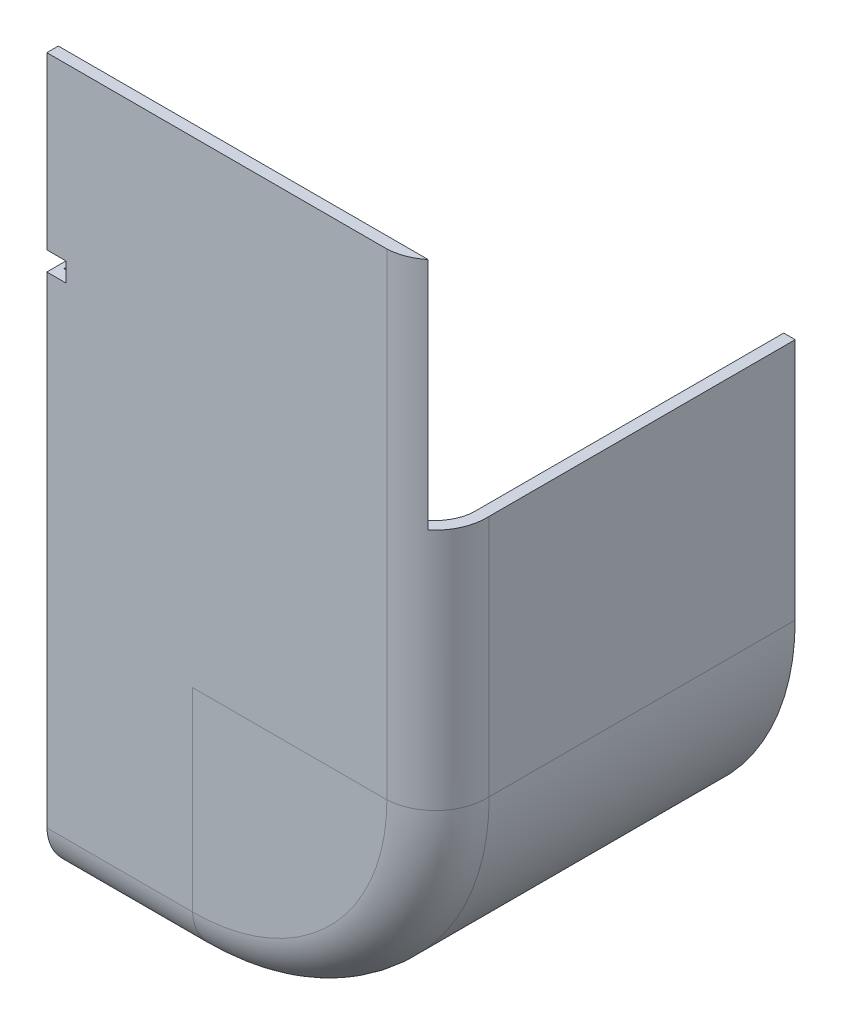
ISO-10303-21;
HEADER;
FILE_DESCRIPTION(('STEP AP214'),'2;1');
FILE_NAME('part.step','',(''),(''),'','','');
FILE_SCHEMA(('AUTOMOTIVE_DESIGN { 1 0 10303 214 1 1 1 1 }'));
ENDSEC;
DATA;
#1=APPLICATION_CONTEXT('core data for automotive mechanical design processes');
#2=APPLICATION_PROTOCOL_DEFINITION('international standard','automotive_design',2000,#1);
#3=PRODUCT_CONTEXT('',#1,'mechanical');
#4=PRODUCT('Part','Part','',(#3));
#5=PRODUCT_RELATED_PRODUCT_CATEGORY('part','',(#4));
#6=PRODUCT_DEFINITION_FORMATION('','',#4);
#7=PRODUCT_DEFINITION_CONTEXT('part definition',#1,'design');
#8=PRODUCT_DEFINITION('design','',#6,#7);
#9=PRODUCT_DEFINITION_SHAPE('','',#8);
#10=(LENGTH_UNIT() NAMED_UNIT(*) SI_UNIT(.MILLI.,.METRE.));
#11=(NAMED_UNIT(*) PLANE_ANGLE_UNIT() SI_UNIT($,.RADIAN.));
#12=(NAMED_UNIT(*) SI_UNIT($,.STERADIAN.) SOLID_ANGLE_UNIT());
#13=UNCERTAINTY_MEASURE_WITH_UNIT(LENGTH_MEASURE(1.E-05),#10,'distance_accuracy_value','');
#14=(GEOMETRIC_REPRESENTATION_CONTEXT(3) GLOBAL_UNCERTAINTY_ASSIGNED_CONTEXT((#13)) GLOBAL_UNIT_ASSIGNED_CONTEXT((#10,
#11,#12)) REPRESENTATION_CONTEXT('',''));
#15=CARTESIAN_POINT('',(0.,0.,0.));
#16=DIRECTION('',(0.,0.,1.));
#17=DIRECTION('',(1.,0.,0.));
#18=AXIS2_PLACEMENT_3D('',#15,#16,#17);
#19=CARTESIAN_POINT('',(-38.1,101.6,91.0390992622291));
#20=DIRECTION('',(0.,0.,1.));
#21=DIRECTION('',(1.,0.,0.));
#22=AXIS2_PLACEMENT_3D('',#19,#20,#21);
#23=PLANE('',#22);
#24=DIRECTION('',(-1.,0.,0.));
#25=VECTOR('',#24,1.);
#26=CARTESIAN_POINT('',(-38.1,41.9405176116687,91.0390992622291));
#27=LINE('',#26,#25);
#28=CARTESIAN_POINT('',(5.,41.9405176116687,91.0390992622291));
#29=VERTEX_POINT('',#28);
#30=CARTESIAN_POINT('',(0.,41.9405176116687,91.0390992622291));
#31=VERTEX_POINT('',#30);
#32=EDGE_CURVE('E285',#29,#31,#27,.T.);
#33=ORIENTED_EDGE('',*,*,#32,.T.);
#34=DIRECTION('',(0.,1.,0.));
#35=VECTOR('',#34,1.);
#36=CARTESIAN_POINT('',(0.,101.6,91.0390992622291));
#37=LINE('',#36,#35);
#38=CARTESIAN_POINT('',(0.,86.6,91.0390992622291));
#39=VERTEX_POINT('',#38);
#40=EDGE_CURVE('E282',#31,#39,#37,.T.);
#41=ORIENTED_EDGE('',*,*,#40,.T.);
#42=DIRECTION('',(-1.,0.,0.));
#43=VECTOR('',#42,1.);
#44=CARTESIAN_POINT('',(-38.1,86.6,91.0390992622291));
#45=LINE('',#44,#43);
#46=CARTESIAN_POINT('',(96.6960037763841,86.6,91.0390992622291));
#47=VERTEX_POINT('',#46);
#48=EDGE_CURVE('E307',#47,#39,#45,.T.);
#49=ORIENTED_EDGE('',*,*,#48,.F.);
#50=DIRECTION('',(0.,1.,0.));
#51=VECTOR('',#50,1.);
#52=CARTESIAN_POINT('',(96.6960037763841,-38.0999999999997,91.0390992622291));
#53=LINE('',#52,#51);
#54=CARTESIAN_POINT('',(96.6960037763841,25.4,91.0390992622291));
#55=VERTEX_POINT('',#54);
#56=EDGE_CURVE('E340',#55,#47,#53,.T.);
#57=ORIENTED_EDGE('',*,*,#56,.F.);
#58=DIRECTION('',(1.,0.,0.));
#59=VECTOR('',#58,1.);
#60=CARTESIAN_POINT('',(122.458490874742,25.4,91.0390992622291));
#61=LINE('',#60,#59);
#62=CARTESIAN_POINT('',(88.8999999999999,25.4,91.0390992622291));
#63=VERTEX_POINT('',#62);
#64=EDGE_CURVE('E348',#63,#55,#61,.T.);
#65=ORIENTED_EDGE('',*,*,#64,.F.);
#66=DIRECTION('',(0.,1.,0.));
#67=VECTOR('',#66,1.);
#68=CARTESIAN_POINT('',(88.9,-38.0999999999997,91.0390992622291));
#69=LINE('',#68,#67);
#70=CARTESIAN_POINT('',(88.9,-38.0999999999997,91.0390992622291));
#71=VERTEX_POINT('',#70);
#72=EDGE_CURVE('E528',#71,#63,#69,.T.);
#73=ORIENTED_EDGE('',*,*,#72,.F.);
#74=DIRECTION('',(1.,0.,0.));
#75=VECTOR('',#74,1.);
#76=CARTESIAN_POINT('',(38.1,-38.0999999999996,91.0390992622291));
#77=LINE('',#76,#75);
#78=CARTESIAN_POINT('',(38.0999999999997,-38.1000000000001,91.0390992622291));
#79=VERTEX_POINT('',#78);
#80=EDGE_CURVE('E414',#79,#71,#77,.T.);
#81=ORIENTED_EDGE('',*,*,#80,.F.);
#82=DIRECTION('',(0.,-1.,0.));
#83=VECTOR('',#82,1.);
#84=CARTESIAN_POINT('',(38.0999999999997,-38.1000000000001,91.0390992622291));
#85=LINE('',#84,#83);
#86=CARTESIAN_POINT('',(38.0999999999996,-88.9000000000001,91.0390992622291));
#87=VERTEX_POINT('',#86);
#88=EDGE_CURVE('E284',#79,#87,#85,.T.);
#89=ORIENTED_EDGE('',*,*,#88,.T.);
#90=DIRECTION('',(1.,0.,0.));
#91=VECTOR('',#90,1.);
#92=CARTESIAN_POINT('',(-38.0999999999999,-88.9,91.0390992622291));
#93=LINE('',#92,#91);
#94=CARTESIAN_POINT('',(1.50000000000002,-88.9000000000001,91.0390992622291));
#95=VERTEX_POINT('',#94);
#96=EDGE_CURVE('E314',#95,#87,#93,.T.);
#97=ORIENTED_EDGE('',*,*,#96,.F.);
#98=DIRECTION('',(0.,-1.,0.));
#99=VECTOR('',#98,1.);
#100=CARTESIAN_POINT('',(1.50000000000002,36.9405176116687,91.0390992622291));
#101=LINE('',#100,#99);
#102=CARTESIAN_POINT('',(1.50000000000002,36.9405176116687,91.0390992622291));
#103=VERTEX_POINT('',#102);
#104=EDGE_CURVE('E258',#103,#95,#101,.T.);
#105=ORIENTED_EDGE('',*,*,#104,.F.);
#106=DIRECTION('',(1.,0.,0.));
#107=VECTOR('',#106,1.);
#108=CARTESIAN_POINT('',(-38.1,36.9405176116687,91.0390992622291));
#109=LINE('',#108,#107);
#110=CARTESIAN_POINT('',(5.,36.9405176116687,91.0390992622291));
#111=VERTEX_POINT('',#110);
#112=EDGE_CURVE('E253',#103,#111,#109,.T.);
#113=ORIENTED_EDGE('',*,*,#112,.T.);
#114=DIRECTION('',(0.,1.,0.));
#115=VECTOR('',#114,1.);
#116=CARTESIAN_POINT('',(4.99999999999998,101.6,91.0390992622291));
#117=LINE('',#116,#115);
#118=EDGE_CURVE('E426',#111,#29,#117,.T.);
#119=ORIENTED_EDGE('',*,*,#118,.T.);
#120=EDGE_LOOP('',(#33,#41,#49,#57,#65,#73,#81,#89,#97,#105,#113,#119));
#121=FACE_BOUND('',#120,.T.);
#122=ADVANCED_FACE('F70',(#121),#23,.F.);
#123=CARTESIAN_POINT('',(-38.0999999999999,-98.6,60.));
#124=DIRECTION('',(0.,1.,0.));
#125=DIRECTION('',(0.,0.,1.));
#126=AXIS2_PLACEMENT_3D('',#123,#124,#125);
#127=PLANE('',#126);
#128=DIRECTION('',(1.,0.,0.));
#129=VECTOR('',#128,1.);
#130=CARTESIAN_POINT('',(-38.0999999999999,-98.6,40.));
#131=LINE('',#130,#129);
#132=CARTESIAN_POINT('',(1.49999999999999,-98.6,40.));
#133=VERTEX_POINT('',#132);
#134=CARTESIAN_POINT('',(27.4999999999999,-98.6,40.));
#135=VERTEX_POINT('',#134);
#136=EDGE_CURVE('E370',#133,#135,#131,.T.);
#137=ORIENTED_EDGE('',*,*,#136,.F.);
#138=DIRECTION('',(0.,0.,-1.));
#139=VECTOR('',#138,1.);
#140=CARTESIAN_POINT('',(1.5,-98.6,80.));
#141=LINE('',#140,#139);
#142=CARTESIAN_POINT('',(1.5,-98.6,80.));
#143=VERTEX_POINT('',#142);
#144=EDGE_CURVE('E386',#143,#133,#141,.T.);
#145=ORIENTED_EDGE('',*,*,#144,.F.);
#146=DIRECTION('',(1.,0.,0.));
#147=VECTOR('',#146,1.);
#148=CARTESIAN_POINT('',(-38.0999999999999,-98.6,80.));
#149=LINE('',#148,#147);
#150=CARTESIAN_POINT('',(38.0999999999996,-98.6000000000001,80.));
#151=VERTEX_POINT('',#150);
#152=EDGE_CURVE('E529',#143,#151,#149,.T.);
#153=ORIENTED_EDGE('',*,*,#152,.T.);
#154=DIRECTION('',(0.,0.,-1.));
#155=VECTOR('',#154,1.);
#156=CARTESIAN_POINT('',(38.0999999999995,-98.6,60.));
#157=LINE('',#156,#155);
#158=CARTESIAN_POINT('',(38.0999999999995,-98.6,0.));
#159=VERTEX_POINT('',#158);
#160=EDGE_CURVE('E530',#151,#159,#157,.T.);
#161=ORIENTED_EDGE('',*,*,#160,.T.);
#162=DIRECTION('',(1.,0.,0.));
#163=VECTOR('',#162,1.);
#164=CARTESIAN_POINT('',(-38.0999999999999,-98.6,0.));
#165=LINE('',#164,#163);
#166=CARTESIAN_POINT('',(27.4999999999999,-98.6,0.));
#167=VERTEX_POINT('',#166);
#168=EDGE_CURVE('E343',#167,#159,#165,.T.);
#169=ORIENTED_EDGE('',*,*,#168,.F.);
#170=DIRECTION('',(0.,0.,-1.));
#171=VECTOR('',#170,1.);
#172=CARTESIAN_POINT('',(27.4999999999999,-98.6,60.));
#173=LINE('',#172,#171);
#174=EDGE_CURVE('E361',#135,#167,#173,.T.);
#175=ORIENTED_EDGE('',*,*,#174,.F.);
#176=EDGE_LOOP('',(#137,#145,#153,#161,#169,#175));
#177=FACE_BOUND('',#176,.T.);
#178=ADVANCED_FACE('F467',(#177),#127,.T.);
#179=CARTESIAN_POINT('',(-38.1,101.6,94.0390992622291));
#180=DIRECTION('',(0.,0.,-1.));
#181=DIRECTION('',(-1.,0.,0.));
#182=AXIS2_PLACEMENT_3D('',#179,#180,#181);
#183=PLANE('',#182);
#184=DIRECTION('',(1.,0.,0.));
#185=VECTOR('',#184,1.);
#186=CARTESIAN_POINT('',(-38.1,86.6,94.0390992622291));
#187=LINE('',#186,#185);
#188=CARTESIAN_POINT('',(0.,86.6,94.0390992622291));
#189=VERTEX_POINT('',#188);
#190=CARTESIAN_POINT('',(88.9,86.6,94.0390992622291));
#191=VERTEX_POINT('',#190);
#192=EDGE_CURVE('E369',#189,#191,#187,.T.);
#193=ORIENTED_EDGE('',*,*,#192,.F.);
#194=DIRECTION('',(0.,-1.,0.));
#195=VECTOR('',#194,1.);
#196=CARTESIAN_POINT('',(0.,101.6,94.0390992622291));
#197=LINE('',#196,#195);
#198=CARTESIAN_POINT('',(0.,41.9405176116687,94.0390992622291));
#199=VERTEX_POINT('',#198);
#200=EDGE_CURVE('E312',#189,#199,#197,.T.);
#201=ORIENTED_EDGE('',*,*,#200,.T.);
#202=DIRECTION('',(-1.,0.,0.));
#203=VECTOR('',#202,1.);
#204=CARTESIAN_POINT('',(-5.,41.9405176116687,94.0390992622291));
#205=LINE('',#204,#203);
#206=CARTESIAN_POINT('',(5.,41.9405176116687,94.0390992622291));
#207=VERTEX_POINT('',#206);
#208=EDGE_CURVE('E281',#207,#199,#205,.T.);
#209=ORIENTED_EDGE('',*,*,#208,.F.);
#210=DIRECTION('',(0.,1.,0.));
#211=VECTOR('',#210,1.);
#212=CARTESIAN_POINT('',(5.,41.9405176116687,94.0390992622291));
#213=LINE('',#212,#211);
#214=CARTESIAN_POINT('',(5.,36.9405176116687,94.0390992622291));
#215=VERTEX_POINT('',#214);
#216=EDGE_CURVE('E271',#215,#207,#213,.T.);
#217=ORIENTED_EDGE('',*,*,#216,.F.);
#218=DIRECTION('',(1.,0.,0.));
#219=VECTOR('',#218,1.);
#220=CARTESIAN_POINT('',(-5.,36.9405176116687,94.0390992622291));
#221=LINE('',#220,#219);
#222=CARTESIAN_POINT('',(0.,36.9405176116687,94.0390992622291));
#223=VERTEX_POINT('',#222);
#224=EDGE_CURVE('E273',#223,#215,#221,.T.);
#225=ORIENTED_EDGE('',*,*,#224,.F.);
#226=CARTESIAN_POINT('',(0.,-88.9000000000001,94.0390992622291));
#227=VERTEX_POINT('',#226);
#228=EDGE_CURVE('E308',#223,#227,#197,.T.);
#229=ORIENTED_EDGE('',*,*,#228,.T.);
#230=DIRECTION('',(1.,0.,0.));
#231=VECTOR('',#230,1.);
#232=CARTESIAN_POINT('',(-38.0999999999999,-88.9,94.0390992622291));
#233=LINE('',#232,#231);
#234=CARTESIAN_POINT('',(38.0999999999996,-88.9000000000001,94.0390992622291));
#235=VERTEX_POINT('',#234);
#236=EDGE_CURVE('E311',#227,#235,#233,.T.);
#237=ORIENTED_EDGE('',*,*,#236,.T.);
#238=DIRECTION('',(0.,1.,0.));
#239=VECTOR('',#238,1.);
#240=CARTESIAN_POINT('',(38.0999999999997,-38.1000000000001,94.0390992622291));
#241=LINE('',#240,#239);
#242=CARTESIAN_POINT('',(38.0999999999997,-38.1000000000001,94.0390992622291));
#243=VERTEX_POINT('',#242);
#244=EDGE_CURVE('E433',#235,#243,#241,.T.);
#245=ORIENTED_EDGE('',*,*,#244,.T.);
#246=DIRECTION('',(-1.,0.,0.));
#247=VECTOR('',#246,1.);
#248=CARTESIAN_POINT('',(38.1,-38.0999999999996,94.0390992622291));
#249=LINE('',#248,#247);
#250=CARTESIAN_POINT('',(88.9,-38.0999999999997,94.0390992622291));
#251=VERTEX_POINT('',#250);
#252=EDGE_CURVE('E430',#251,#243,#249,.T.);
#253=ORIENTED_EDGE('',*,*,#252,.F.);
#254=DIRECTION('',(0.,1.,0.));
#255=VECTOR('',#254,1.);
#256=CARTESIAN_POINT('',(88.9,-38.0999999999997,94.0390992622291));
#257=LINE('',#256,#255);
#258=EDGE_CURVE('E335',#251,#191,#257,.T.);
#259=ORIENTED_EDGE('',*,*,#258,.T.);
#260=EDGE_LOOP('',(#193,#201,#209,#217,#225,#229,#237,#245,#253,#259));
#261=FACE_BOUND('',#260,.T.);
#262=ADVANCED_FACE('F453',(#261),#183,.F.);
#263=CARTESIAN_POINT('',(88.2304503688854,-38.0999999999997,80.6695496311146));
#264=DIRECTION('',(0.,1.,0.));
#265=DIRECTION('',(0.,0.,1.));
#266=AXIS2_PLACEMENT_3D('',#263,#264,#265);
#267=CYLINDRICAL_SURFACE('',#266,13.3863047196514);
#268=CARTESIAN_POINT('',(88.2304503688854,86.6,80.6695496311146));
#269=DIRECTION('',(0.,1.,0.));
#270=DIRECTION('',(-1.,0.,0.));
#271=AXIS2_PLACEMENT_3D('',#268,#269,#270);
#272=CIRCLE('',#271,13.3863047196514);
#273=EDGE_CURVE('E379',#191,#47,#272,.T.);
#274=ORIENTED_EDGE('',*,*,#273,.F.);
#275=ORIENTED_EDGE('',*,*,#258,.F.);
#276=CARTESIAN_POINT('',(88.2304503688854,-38.0999999999997,80.6695496311146));
#277=DIRECTION('',(0.,-1.,0.));
#278=DIRECTION('',(1.,0.,0.));
#279=AXIS2_PLACEMENT_3D('',#276,#277,#278);
#280=CIRCLE('',#279,13.3863047196514);
#281=CARTESIAN_POINT('',(101.6,-38.0999999999997,80.));
#282=VERTEX_POINT('',#281);
#283=EDGE_CURVE('E338',#282,#251,#280,.T.);
#284=ORIENTED_EDGE('',*,*,#283,.F.);
#285=DIRECTION('',(0.,1.,0.));
#286=VECTOR('',#285,1.);
#287=CARTESIAN_POINT('',(101.6,-38.0999999999997,80.));
#288=LINE('',#287,#286);
#289=CARTESIAN_POINT('',(101.6,25.4,80.));
#290=VERTEX_POINT('',#289);
#291=EDGE_CURVE('E331',#282,#290,#288,.T.);
#292=ORIENTED_EDGE('',*,*,#291,.T.);
#293=CARTESIAN_POINT('',(88.2304503688854,25.4,80.6695496311146));
#294=DIRECTION('',(0.,-1.,0.));
#295=DIRECTION('',(1.,0.,0.));
#296=AXIS2_PLACEMENT_3D('',#293,#294,#295);
#297=CIRCLE('',#296,13.3863047196514);
#298=EDGE_CURVE('E334',#290,#55,#297,.T.);
#299=ORIENTED_EDGE('',*,*,#298,.T.);
#300=ORIENTED_EDGE('',*,*,#56,.T.);
#301=EDGE_LOOP('',(#274,#275,#284,#292,#299,#300));
#302=FACE_BOUND('',#301,.T.);
#303=ADVANCED_FACE('F448',(#302),#267,.T.);
#304=CARTESIAN_POINT('',(38.0999999999995,-38.0999999999996,0.));
#305=DIRECTION('',(0.,0.,1.));
#306=DIRECTION('',(1.,0.,0.));
#307=AXIS2_PLACEMENT_3D('',#304,#305,#306);
#308=PLANE('',#307);
#309=DIRECTION('',(1.,0.,0.));
#310=VECTOR('',#309,1.);
#311=CARTESIAN_POINT('',(-38.0999999999999,-101.6,0.));
#312=LINE('',#311,#310);
#313=CARTESIAN_POINT('',(27.4999999999999,-101.6,0.));
#314=VERTEX_POINT('',#313);
#315=CARTESIAN_POINT('',(38.0999999999998,-101.6,0.));
#316=VERTEX_POINT('',#315);
#317=EDGE_CURVE('E296',#314,#316,#312,.T.);
#318=ORIENTED_EDGE('',*,*,#317,.F.);
#319=DIRECTION('',(0.,-1.,0.));
#320=VECTOR('',#319,1.);
#321=CARTESIAN_POINT('',(27.5000000000001,101.6,0.));
#322=LINE('',#321,#320);
#323=EDGE_CURVE('E371',#167,#314,#322,.T.);
#324=ORIENTED_EDGE('',*,*,#323,.F.);
#325=ORIENTED_EDGE('',*,*,#168,.T.);
#326=CARTESIAN_POINT('',(38.0999999999993,-38.0999999999993,0.));
#327=DIRECTION('',(0.,0.,-1.));
#328=DIRECTION('',(-1.,0.,0.));
#329=AXIS2_PLACEMENT_3D('',#326,#327,#328);
#330=CIRCLE('',#329,60.5000000000007);
#331=CARTESIAN_POINT('',(98.6,-38.0999999999996,0.));
#332=VERTEX_POINT('',#331);
#333=EDGE_CURVE('E517',#332,#159,#330,.T.);
#334=ORIENTED_EDGE('',*,*,#333,.F.);
#335=DIRECTION('',(0.,-1.,0.));
#336=VECTOR('',#335,1.);
#337=CARTESIAN_POINT('',(98.6,98.6,0.));
#338=LINE('',#337,#336);
#339=CARTESIAN_POINT('',(98.6,25.4,0.));
#340=VERTEX_POINT('',#339);
#341=EDGE_CURVE('E302',#340,#332,#338,.T.);
#342=ORIENTED_EDGE('',*,*,#341,.F.);
#343=DIRECTION('',(1.,0.,0.));
#344=VECTOR('',#343,1.);
#345=CARTESIAN_POINT('',(38.0999999999995,25.4,0.));
#346=LINE('',#345,#344);
#347=CARTESIAN_POINT('',(101.6,25.4,0.));
#348=VERTEX_POINT('',#347);
#349=EDGE_CURVE('E350',#340,#348,#346,.T.);
#350=ORIENTED_EDGE('',*,*,#349,.T.);
#351=DIRECTION('',(0.,-1.,0.));
#352=VECTOR('',#351,1.);
#353=CARTESIAN_POINT('',(101.6,101.6,0.));
#354=LINE('',#353,#352);
#355=CARTESIAN_POINT('',(101.6,-38.0999999999996,0.));
#356=VERTEX_POINT('',#355);
#357=EDGE_CURVE('E297',#348,#356,#354,.T.);
#358=ORIENTED_EDGE('',*,*,#357,.T.);
#359=CARTESIAN_POINT('',(38.0999999999995,-38.0999999999996,0.));
#360=DIRECTION('',(0.,0.,1.));
#361=DIRECTION('',(1.,0.,0.));
#362=AXIS2_PLACEMENT_3D('',#359,#360,#361);
#363=CIRCLE('',#362,63.5000000000005);
#364=EDGE_CURVE('E544',#316,#356,#363,.T.);
#365=ORIENTED_EDGE('',*,*,#364,.F.);
#366=EDGE_LOOP('',(#318,#324,#325,#334,#342,#350,#358,#365));
#367=FACE_BOUND('',#366,.T.);
#368=ADVANCED_FACE('F492',(#367),#308,.F.);
#369=CARTESIAN_POINT('',(-38.0999999999999,-101.6,60.));
#370=DIRECTION('',(0.,1.,0.));
#371=DIRECTION('',(-1.,0.,0.));
#372=AXIS2_PLACEMENT_3D('',#369,#370,#371);
#373=PLANE('',#372);
#374=DIRECTION('',(1.,0.,0.));
#375=VECTOR('',#374,1.);
#376=CARTESIAN_POINT('',(-38.0999999999999,-101.6,80.));
#377=LINE('',#376,#375);
#378=CARTESIAN_POINT('',(0.,-101.6,80.));
#379=VERTEX_POINT('',#378);
#380=CARTESIAN_POINT('',(38.0999999999996,-101.6,80.));
#381=VERTEX_POINT('',#380);
#382=EDGE_CURVE('E301',#379,#381,#377,.T.);
#383=ORIENTED_EDGE('',*,*,#382,.F.);
#384=DIRECTION('',(0.,0.,-1.));
#385=VECTOR('',#384,1.);
#386=CARTESIAN_POINT('',(0.,-101.6,60.));
#387=LINE('',#386,#385);
#388=CARTESIAN_POINT('',(0.,-101.6,40.));
#389=VERTEX_POINT('',#388);
#390=EDGE_CURVE('E293',#379,#389,#387,.T.);
#391=ORIENTED_EDGE('',*,*,#390,.T.);
#392=DIRECTION('',(-1.,0.,0.));
#393=VECTOR('',#392,1.);
#394=CARTESIAN_POINT('',(-27.5000000000001,-101.6,40.));
#395=LINE('',#394,#393);
#396=CARTESIAN_POINT('',(27.4999999999999,-101.6,40.));
#397=VERTEX_POINT('',#396);
#398=EDGE_CURVE('E291',#397,#389,#395,.T.);
#399=ORIENTED_EDGE('',*,*,#398,.F.);
#400=DIRECTION('',(0.,0.,1.));
#401=VECTOR('',#400,1.);
#402=CARTESIAN_POINT('',(27.4999999999999,-101.6,0.));
#403=LINE('',#402,#401);
#404=EDGE_CURVE('E373',#314,#397,#403,.T.);
#405=ORIENTED_EDGE('',*,*,#404,.F.);
#406=ORIENTED_EDGE('',*,*,#317,.T.);
#407=DIRECTION('',(0.,0.,-1.));
#408=VECTOR('',#407,1.);
#409=CARTESIAN_POINT('',(38.0999999999998,-101.6,60.));
#410=LINE('',#409,#408);
#411=EDGE_CURVE('E541',#381,#316,#410,.T.);
#412=ORIENTED_EDGE('',*,*,#411,.F.);
#413=EDGE_LOOP('',(#383,#391,#399,#405,#406,#412));
#414=FACE_BOUND('',#413,.T.);
#415=ADVANCED_FACE('F495',(#414),#373,.F.);
#416=CARTESIAN_POINT('',(38.0999999999995,-38.0999999999996,60.));
#417=DIRECTION('',(0.,0.,-1.));
#418=DIRECTION('',(-1.,0.,0.));
#419=AXIS2_PLACEMENT_3D('',#416,#417,#418);
#420=CYLINDRICAL_SURFACE('',#419,63.5000000000005);
#421=ORIENTED_EDGE('',*,*,#364,.T.);
#422=DIRECTION('',(0.,0.,-1.));
#423=VECTOR('',#422,1.);
#424=CARTESIAN_POINT('',(101.6,-38.0999999999996,60.));
#425=LINE('',#424,#423);
#426=EDGE_CURVE('E539',#282,#356,#425,.T.);
#427=ORIENTED_EDGE('',*,*,#426,.F.);
#428=CARTESIAN_POINT('',(38.0999999999996,-38.0999999999997,80.));
#429=DIRECTION('',(0.,0.,1.));
#430=DIRECTION('',(0.,-1.,0.));
#431=AXIS2_PLACEMENT_3D('',#428,#429,#430);
#432=CIRCLE('',#431,63.5000000000004);
#433=EDGE_CURVE('E336',#381,#282,#432,.T.);
#434=ORIENTED_EDGE('',*,*,#433,.F.);
#435=ORIENTED_EDGE('',*,*,#411,.T.);
#436=EDGE_LOOP('',(#421,#427,#434,#435));
#437=FACE_BOUND('',#436,.T.);
#438=ADVANCED_FACE('F499',(#437),#420,.T.);
#439=CARTESIAN_POINT('',(101.6,101.6,60.));
#440=DIRECTION('',(1.,0.,0.));
#441=DIRECTION('',(0.,1.,0.));
#442=AXIS2_PLACEMENT_3D('',#439,#440,#441);
#443=PLANE('',#442);
#444=DIRECTION('',(0.,0.,-1.));
#445=VECTOR('',#444,1.);
#446=CARTESIAN_POINT('',(101.6,25.4,60.));
#447=LINE('',#446,#445);
#448=EDGE_CURVE('E346',#290,#348,#447,.T.);
#449=ORIENTED_EDGE('',*,*,#448,.F.);
#450=ORIENTED_EDGE('',*,*,#291,.F.);
#451=ORIENTED_EDGE('',*,*,#426,.T.);
#452=ORIENTED_EDGE('',*,*,#357,.F.);
#453=EDGE_LOOP('',(#449,#450,#451,#452));
#454=FACE_BOUND('',#453,.T.);
#455=ADVANCED_FACE('F487',(#454),#443,.T.);
#456=CARTESIAN_POINT('',(38.0999999999993,-38.0999999999993,60.));
#457=DIRECTION('',(0.,0.,-1.));
#458=DIRECTION('',(-1.,0.,0.));
#459=AXIS2_PLACEMENT_3D('',#456,#457,#458);
#460=CYLINDRICAL_SURFACE('',#459,60.5000000000007);
#461=ORIENTED_EDGE('',*,*,#333,.T.);
#462=ORIENTED_EDGE('',*,*,#160,.F.);
#463=CARTESIAN_POINT('',(38.0999999999996,-38.0999999999997,80.));
#464=DIRECTION('',(0.,0.,1.));
#465=DIRECTION('',(0.,-1.,0.));
#466=AXIS2_PLACEMENT_3D('',#463,#464,#465);
#467=CIRCLE('',#466,60.5000000000004);
#468=CARTESIAN_POINT('',(98.6,-38.0999999999997,80.));
#469=VERTEX_POINT('',#468);
#470=EDGE_CURVE('E422',#151,#469,#467,.T.);
#471=ORIENTED_EDGE('',*,*,#470,.T.);
#472=DIRECTION('',(0.,0.,-1.));
#473=VECTOR('',#472,1.);
#474=CARTESIAN_POINT('',(98.6,-38.0999999999996,60.));
#475=LINE('',#474,#473);
#476=EDGE_CURVE('E525',#469,#332,#475,.T.);
#477=ORIENTED_EDGE('',*,*,#476,.T.);
#478=EDGE_LOOP('',(#461,#462,#471,#477));
#479=FACE_BOUND('',#478,.T.);
#480=ADVANCED_FACE('F484',(#479),#460,.F.);
#481=CARTESIAN_POINT('',(98.6,98.6,60.));
#482=DIRECTION('',(1.,0.,0.));
#483=DIRECTION('',(0.,0.,-1.));
#484=AXIS2_PLACEMENT_3D('',#481,#482,#483);
#485=PLANE('',#484);
#486=DIRECTION('',(0.,1.,0.));
#487=VECTOR('',#486,1.);
#488=CARTESIAN_POINT('',(98.6,-38.0999999999997,80.));
#489=LINE('',#488,#487);
#490=CARTESIAN_POINT('',(98.6,25.4,80.));
#491=VERTEX_POINT('',#490);
#492=EDGE_CURVE('E356',#469,#491,#489,.T.);
#493=ORIENTED_EDGE('',*,*,#492,.T.);
#494=DIRECTION('',(0.,0.,-1.));
#495=VECTOR('',#494,1.);
#496=CARTESIAN_POINT('',(98.6,25.4,60.));
#497=LINE('',#496,#495);
#498=EDGE_CURVE('E353',#491,#340,#497,.T.);
#499=ORIENTED_EDGE('',*,*,#498,.T.);
#500=ORIENTED_EDGE('',*,*,#341,.T.);
#501=ORIENTED_EDGE('',*,*,#476,.F.);
#502=EDGE_LOOP('',(#493,#499,#500,#501));
#503=FACE_BOUND('',#502,.T.);
#504=ADVANCED_FACE('F482',(#503),#485,.F.);
#505=CARTESIAN_POINT('',(-38.0999999999999,-88.2304503688855,80.6695496311146));
#506=DIRECTION('',(1.,0.,0.));
#507=DIRECTION('',(0.,1.,0.));
#508=AXIS2_PLACEMENT_3D('',#505,#506,#507);
#509=CYLINDRICAL_SURFACE('',#508,13.3863047196514);
#510=ORIENTED_EDGE('',*,*,#236,.F.);
#511=CARTESIAN_POINT('',(0.,-88.2304503688855,80.6695496311146));
#512=DIRECTION('',(1.,0.,0.));
#513=DIRECTION('',(0.,1.,0.));
#514=AXIS2_PLACEMENT_3D('',#511,#512,#513);
#515=CIRCLE('',#514,13.3863047196514);
#516=EDGE_CURVE('E298',#227,#379,#515,.T.);
#517=ORIENTED_EDGE('',*,*,#516,.T.);
#518=ORIENTED_EDGE('',*,*,#382,.T.);
#519=CARTESIAN_POINT('',(38.0999999999996,-88.2304503688855,80.6695496311146));
#520=DIRECTION('',(-1.,0.,0.));
#521=DIRECTION('',(0.,-1.,0.));
#522=AXIS2_PLACEMENT_3D('',#519,#520,#521);
#523=CIRCLE('',#522,13.3863047196514);
#524=EDGE_CURVE('E315',#381,#235,#523,.T.);
#525=ORIENTED_EDGE('',*,*,#524,.T.);
#526=EDGE_LOOP('',(#510,#517,#518,#525));
#527=FACE_BOUND('',#526,.T.);
#528=ADVANCED_FACE('F476',(#527),#509,.T.);
#529=CARTESIAN_POINT('',(-38.0999999999999,-88.0411646290642,80.5032252207029));
#530=DIRECTION('',(1.,0.,0.));
#531=DIRECTION('',(0.,1.,0.));
#532=AXIS2_PLACEMENT_3D('',#529,#530,#531);
#533=CYLINDRICAL_SURFACE('',#532,10.5708202147836);
#534=DIRECTION('',(1.,0.,0.));
#535=VECTOR('',#534,1.);
#536=CARTESIAN_POINT('',(-1.31838984174237E-13,-98.6,80.));
#537=LINE('',#536,#535);
#538=CARTESIAN_POINT('',(0.,-98.6000000000001,80.));
#539=VERTEX_POINT('',#538);
#540=EDGE_CURVE('E306',#539,#143,#537,.T.);
#541=ORIENTED_EDGE('',*,*,#540,.F.);
#542=CARTESIAN_POINT('',(0.,-88.0411646290642,80.5032252207029));
#543=DIRECTION('',(1.,0.,0.));
#544=DIRECTION('',(0.,1.,0.));
#545=AXIS2_PLACEMENT_3D('',#542,#543,#544);
#546=CIRCLE('',#545,10.5708202147836);
#547=CARTESIAN_POINT('',(0.,-88.8999999999999,91.0390992622291));
#548=VERTEX_POINT('',#547);
#549=EDGE_CURVE('E313',#539,#548,#546,.F.);
#550=ORIENTED_EDGE('',*,*,#549,.T.);
#551=DIRECTION('',(-1.,0.,0.));
#552=VECTOR('',#551,1.);
#553=CARTESIAN_POINT('',(1.5,-88.9000000000001,91.0390992622291));
#554=LINE('',#553,#552);
#555=EDGE_CURVE('E257',#95,#548,#554,.T.);
#556=ORIENTED_EDGE('',*,*,#555,.F.);
#557=ORIENTED_EDGE('',*,*,#96,.T.);
#558=CARTESIAN_POINT('',(38.0999999999996,-88.0411646290643,80.5032252207029));
#559=DIRECTION('',(1.,0.,0.));
#560=DIRECTION('',(0.,-1.,0.));
#561=AXIS2_PLACEMENT_3D('',#558,#559,#560);
#562=CIRCLE('',#561,10.5708202147836);
#563=EDGE_CURVE('E320',#87,#151,#562,.T.);
#564=ORIENTED_EDGE('',*,*,#563,.T.);
#565=ORIENTED_EDGE('',*,*,#152,.F.);
#566=EDGE_LOOP('',(#541,#550,#556,#557,#564,#565));
#567=FACE_BOUND('',#566,.T.);
#568=ADVANCED_FACE('F402',(#567),#533,.F.);
#569=CARTESIAN_POINT('',(38.0999999999996,-38.0999999999997,80.6695496311146));
#570=DIRECTION('',(0.,0.,1.));
#571=DIRECTION('',(1.,0.,0.));
#572=AXIS2_PLACEMENT_3D('',#569,#570,#571);
#573=TOROIDAL_SURFACE('',#572,50.1304503688859,13.3863047196514);
#574=CARTESIAN_POINT('',(38.0999999999996,-38.0999999999997,94.0390992622291));
#575=DIRECTION('',(0.,0.,1.));
#576=DIRECTION('',(0.,-1.,0.));
#577=AXIS2_PLACEMENT_3D('',#574,#575,#576);
#578=CIRCLE('',#577,50.8000000000004);
#579=EDGE_CURVE('E432',#235,#251,#578,.T.);
#580=ORIENTED_EDGE('',*,*,#579,.F.);
#581=ORIENTED_EDGE('',*,*,#524,.F.);
#582=ORIENTED_EDGE('',*,*,#433,.T.);
#583=ORIENTED_EDGE('',*,*,#283,.T.);
#584=EDGE_LOOP('',(#580,#581,#582,#583));
#585=FACE_BOUND('',#584,.T.);
#586=ADVANCED_FACE('F443',(#585),#573,.T.);
#587=CARTESIAN_POINT('',(38.0999999999996,-38.1000000000001,94.0390992622291));
#588=DIRECTION('',(0.,0.,-1.));
#589=DIRECTION('',(-1.,0.,0.));
#590=AXIS2_PLACEMENT_3D('',#587,#588,#589);
#591=PLANE('',#590);
#592=ORIENTED_EDGE('',*,*,#244,.F.);
#593=ORIENTED_EDGE('',*,*,#579,.T.);
#594=ORIENTED_EDGE('',*,*,#252,.T.);
#595=EDGE_LOOP('',(#592,#593,#594));
#596=FACE_BOUND('',#595,.T.);
#597=ADVANCED_FACE('F455',(#596),#591,.F.);
#598=CARTESIAN_POINT('',(38.0999999999996,-38.1000000000001,91.0390992622291));
#599=DIRECTION('',(0.,0.,1.));
#600=DIRECTION('',(1.,0.,0.));
#601=AXIS2_PLACEMENT_3D('',#598,#599,#600);
#602=PLANE('',#601);
#603=CARTESIAN_POINT('',(38.0999999999996,-38.0999999999997,91.0390992622291));
#604=DIRECTION('',(0.,0.,1.));
#605=DIRECTION('',(0.,-1.,0.));
#606=AXIS2_PLACEMENT_3D('',#603,#604,#605);
#607=CIRCLE('',#606,50.8000000000004);
#608=EDGE_CURVE('E412',#87,#71,#607,.T.);
#609=ORIENTED_EDGE('',*,*,#608,.F.);
#610=ORIENTED_EDGE('',*,*,#88,.F.);
#611=ORIENTED_EDGE('',*,*,#80,.T.);
#612=EDGE_LOOP('',(#609,#610,#611));
#613=FACE_BOUND('',#612,.T.);
#614=ADVANCED_FACE('F413',(#613),#602,.F.);
#615=CARTESIAN_POINT('',(38.0999999999996,-38.0999999999997,80.5032252207029));
#616=DIRECTION('',(0.,0.,1.));
#617=DIRECTION('',(1.,0.,0.));
#618=AXIS2_PLACEMENT_3D('',#615,#616,#617);
#619=TOROIDAL_SURFACE('',#618,49.9411646290646,10.5708202147836);
#620=ORIENTED_EDGE('',*,*,#470,.F.);
#621=ORIENTED_EDGE('',*,*,#563,.F.);
#622=ORIENTED_EDGE('',*,*,#608,.T.);
#623=CARTESIAN_POINT('',(88.0411646290642,-38.0999999999997,80.5032252207029));
#624=DIRECTION('',(0.,1.,0.));
#625=DIRECTION('',(1.,0.,0.));
#626=AXIS2_PLACEMENT_3D('',#623,#624,#625);
#627=CIRCLE('',#626,10.5708202147836);
#628=EDGE_CURVE('E417',#71,#469,#627,.T.);
#629=ORIENTED_EDGE('',*,*,#628,.T.);
#630=EDGE_LOOP('',(#620,#621,#622,#629));
#631=FACE_BOUND('',#630,.T.);
#632=ADVANCED_FACE('F420',(#631),#619,.F.);
#633=CARTESIAN_POINT('',(88.0411646290642,-38.0999999999997,80.5032252207029));
#634=DIRECTION('',(0.,1.,0.));
#635=DIRECTION('',(0.,0.,1.));
#636=AXIS2_PLACEMENT_3D('',#633,#634,#635);
#637=CYLINDRICAL_SURFACE('',#636,10.5708202147836);
#638=ORIENTED_EDGE('',*,*,#72,.T.);
#639=CARTESIAN_POINT('',(88.0411646290642,25.4,80.5032252207029));
#640=DIRECTION('',(0.,-1.,0.));
#641=DIRECTION('',(1.,0.,0.));
#642=AXIS2_PLACEMENT_3D('',#639,#640,#641);
#643=CIRCLE('',#642,10.5708202147836);
#644=EDGE_CURVE('E349',#63,#491,#643,.F.);
#645=ORIENTED_EDGE('',*,*,#644,.T.);
#646=ORIENTED_EDGE('',*,*,#492,.F.);
#647=ORIENTED_EDGE('',*,*,#628,.F.);
#648=EDGE_LOOP('',(#638,#645,#646,#647));
#649=FACE_BOUND('',#648,.T.);
#650=ADVANCED_FACE('F479',(#649),#637,.F.);
#651=CARTESIAN_POINT('',(0.,25.4,0.));
#652=DIRECTION('',(0.,-1.,0.));
#653=DIRECTION('',(1.,0.,0.));
#654=AXIS2_PLACEMENT_3D('',#651,#652,#653);
#655=PLANE('',#654);
#656=ORIENTED_EDGE('',*,*,#448,.T.);
#657=ORIENTED_EDGE('',*,*,#349,.F.);
#658=ORIENTED_EDGE('',*,*,#498,.F.);
#659=ORIENTED_EDGE('',*,*,#644,.F.);
#660=ORIENTED_EDGE('',*,*,#64,.T.);
#661=ORIENTED_EDGE('',*,*,#298,.F.);
#662=EDGE_LOOP('',(#656,#657,#658,#659,#660,#661));
#663=FACE_BOUND('',#662,.T.);
#664=ADVANCED_FACE('F72',(#663),#655,.F.);
#665=CARTESIAN_POINT('',(5.,41.9405176116687,0.));
#666=DIRECTION('',(1.,0.,0.));
#667=DIRECTION('',(0.,1.,0.));
#668=AXIS2_PLACEMENT_3D('',#665,#666,#667);
#669=PLANE('',#668);
#670=DIRECTION('',(0.,0.,1.));
#671=VECTOR('',#670,1.);
#672=CARTESIAN_POINT('',(5.,36.9405176116687,0.));
#673=LINE('',#672,#671);
#674=EDGE_CURVE('E274',#111,#215,#673,.T.);
#675=ORIENTED_EDGE('',*,*,#674,.T.);
#676=ORIENTED_EDGE('',*,*,#216,.T.);
#677=DIRECTION('',(0.,0.,1.));
#678=VECTOR('',#677,1.);
#679=CARTESIAN_POINT('',(5.,41.9405176116687,0.));
#680=LINE('',#679,#678);
#681=EDGE_CURVE('E280',#29,#207,#680,.T.);
#682=ORIENTED_EDGE('',*,*,#681,.F.);
#683=ORIENTED_EDGE('',*,*,#118,.F.);
#684=EDGE_LOOP('',(#675,#676,#682,#683));
#685=FACE_BOUND('',#684,.T.);
#686=ADVANCED_FACE('F571',(#685),#669,.F.);
#687=CARTESIAN_POINT('',(-5.,36.9405176116687,0.));
#688=DIRECTION('',(0.,-1.,0.));
#689=DIRECTION('',(0.,0.,-1.));
#690=AXIS2_PLACEMENT_3D('',#687,#688,#689);
#691=PLANE('',#690);
#692=DIRECTION('',(-1.,0.,0.));
#693=VECTOR('',#692,1.);
#694=CARTESIAN_POINT('',(1.50000000000002,36.9405176116687,87.0390992622291));
#695=LINE('',#694,#693);
#696=CARTESIAN_POINT('',(1.50000000000002,36.9405176116687,87.0390992622291));
#697=VERTEX_POINT('',#696);
#698=CARTESIAN_POINT('',(0.,36.9405176116687,87.0390992622291));
#699=VERTEX_POINT('',#698);
#700=EDGE_CURVE('E251',#697,#699,#695,.T.);
#701=ORIENTED_EDGE('',*,*,#700,.T.);
#702=DIRECTION('',(0.,0.,1.));
#703=VECTOR('',#702,1.);
#704=CARTESIAN_POINT('',(0.,36.9405176116687,0.));
#705=LINE('',#704,#703);
#706=EDGE_CURVE('E130',#699,#223,#705,.T.);
#707=ORIENTED_EDGE('',*,*,#706,.T.);
#708=ORIENTED_EDGE('',*,*,#224,.T.);
#709=ORIENTED_EDGE('',*,*,#674,.F.);
#710=ORIENTED_EDGE('',*,*,#112,.F.);
#711=DIRECTION('',(0.,0.,1.));
#712=VECTOR('',#711,1.);
#713=CARTESIAN_POINT('',(1.50000000000002,36.9405176116687,87.0390992622291));
#714=LINE('',#713,#712);
#715=EDGE_CURVE('E247',#697,#103,#714,.T.);
#716=ORIENTED_EDGE('',*,*,#715,.F.);
#717=EDGE_LOOP('',(#701,#707,#708,#709,#710,#716));
#718=FACE_BOUND('',#717,.T.);
#719=ADVANCED_FACE('F249',(#718),#691,.F.);
#720=CARTESIAN_POINT('',(-5.,41.9405176116687,0.));
#721=DIRECTION('',(0.,1.,0.));
#722=DIRECTION('',(0.,0.,1.));
#723=AXIS2_PLACEMENT_3D('',#720,#721,#722);
#724=PLANE('',#723);
#725=ORIENTED_EDGE('',*,*,#208,.T.);
#726=DIRECTION('',(0.,0.,-1.));
#727=VECTOR('',#726,1.);
#728=CARTESIAN_POINT('',(0.,41.9405176116687,0.));
#729=LINE('',#728,#727);
#730=EDGE_CURVE('E89',#199,#31,#729,.T.);
#731=ORIENTED_EDGE('',*,*,#730,.T.);
#732=ORIENTED_EDGE('',*,*,#32,.F.);
#733=ORIENTED_EDGE('',*,*,#681,.T.);
#734=EDGE_LOOP('',(#725,#731,#732,#733));
#735=FACE_BOUND('',#734,.T.);
#736=ADVANCED_FACE('F576',(#735),#724,.F.);
#737=CARTESIAN_POINT('',(27.5000000000001,101.6,0.));
#738=DIRECTION('',(1.,0.,0.));
#739=DIRECTION('',(0.,1.,0.));
#740=AXIS2_PLACEMENT_3D('',#737,#738,#739);
#741=PLANE('',#740);
#742=ORIENTED_EDGE('',*,*,#174,.T.);
#743=ORIENTED_EDGE('',*,*,#323,.T.);
#744=ORIENTED_EDGE('',*,*,#404,.T.);
#745=DIRECTION('',(0.,-1.,0.));
#746=VECTOR('',#745,1.);
#747=CARTESIAN_POINT('',(27.5000000000001,101.6,40.));
#748=LINE('',#747,#746);
#749=EDGE_CURVE('E367',#135,#397,#748,.T.);
#750=ORIENTED_EDGE('',*,*,#749,.F.);
#751=EDGE_LOOP('',(#742,#743,#744,#750));
#752=FACE_BOUND('',#751,.T.);
#753=ADVANCED_FACE('F578',(#752),#741,.F.);
#754=CARTESIAN_POINT('',(-27.4999999999999,101.6,40.));
#755=DIRECTION('',(0.,0.,1.));
#756=DIRECTION('',(1.,0.,0.));
#757=AXIS2_PLACEMENT_3D('',#754,#755,#756);
#758=PLANE('',#757);
#759=ORIENTED_EDGE('',*,*,#398,.T.);
#760=DIRECTION('',(0.,1.,0.));
#761=VECTOR('',#760,1.);
#762=CARTESIAN_POINT('',(0.,101.6,40.));
#763=LINE('',#762,#761);
#764=CARTESIAN_POINT('',(0.,-94.6,40.));
#765=VERTEX_POINT('',#764);
#766=EDGE_CURVE('E287',#389,#765,#763,.T.);
#767=ORIENTED_EDGE('',*,*,#766,.T.);
#768=DIRECTION('',(-1.,0.,0.));
#769=VECTOR('',#768,1.);
#770=CARTESIAN_POINT('',(-1.5,-94.6,40.));
#771=LINE('',#770,#769);
#772=CARTESIAN_POINT('',(1.5,-94.6,40.));
#773=VERTEX_POINT('',#772);
#774=EDGE_CURVE('E394',#773,#765,#771,.T.);
#775=ORIENTED_EDGE('',*,*,#774,.F.);
#776=DIRECTION('',(0.,-1.,0.));
#777=VECTOR('',#776,1.);
#778=CARTESIAN_POINT('',(1.5,-94.6,40.));
#779=LINE('',#778,#777);
#780=EDGE_CURVE('E290',#773,#133,#779,.T.);
#781=ORIENTED_EDGE('',*,*,#780,.T.);
#782=ORIENTED_EDGE('',*,*,#136,.T.);
#783=ORIENTED_EDGE('',*,*,#749,.T.);
#784=EDGE_LOOP('',(#759,#767,#775,#781,#782,#783));
#785=FACE_BOUND('',#784,.T.);
#786=ADVANCED_FACE('F584',(#785),#758,.F.);
#787=CARTESIAN_POINT('',(0.,86.6,0.));
#788=DIRECTION('',(0.,1.,0.));
#789=DIRECTION('',(-1.,0.,0.));
#790=AXIS2_PLACEMENT_3D('',#787,#788,#789);
#791=PLANE('',#790);
#792=DIRECTION('',(0.,0.,-1.));
#793=VECTOR('',#792,1.);
#794=CARTESIAN_POINT('',(0.,86.6,0.));
#795=LINE('',#794,#793);
#796=EDGE_CURVE('E12',#189,#39,#795,.T.);
#797=ORIENTED_EDGE('',*,*,#796,.F.);
#798=ORIENTED_EDGE('',*,*,#192,.T.);
#799=ORIENTED_EDGE('',*,*,#273,.T.);
#800=ORIENTED_EDGE('',*,*,#48,.T.);
#801=EDGE_LOOP('',(#797,#798,#799,#800));
#802=FACE_BOUND('',#801,.T.);
#803=ADVANCED_FACE('F561',(#802),#791,.T.);
#804=CARTESIAN_POINT('',(-1.31838984174237E-13,-94.6,80.));
#805=DIRECTION('',(0.,0.,-1.));
#806=DIRECTION('',(-1.,0.,0.));
#807=AXIS2_PLACEMENT_3D('',#804,#805,#806);
#808=PLANE('',#807);
#809=DIRECTION('',(1.,0.,0.));
#810=VECTOR('',#809,1.);
#811=CARTESIAN_POINT('',(-1.31838984174237E-13,-94.6,80.));
#812=LINE('',#811,#810);
#813=CARTESIAN_POINT('',(0.,-94.6,80.));
#814=VERTEX_POINT('',#813);
#815=CARTESIAN_POINT('',(1.5,-94.6,80.));
#816=VERTEX_POINT('',#815);
#817=EDGE_CURVE('E385',#814,#816,#812,.T.);
#818=ORIENTED_EDGE('',*,*,#817,.F.);
#819=DIRECTION('',(0.,-1.,0.));
#820=VECTOR('',#819,1.);
#821=CARTESIAN_POINT('',(0.,-94.6,80.));
#822=LINE('',#821,#820);
#823=EDGE_CURVE('E303',#814,#539,#822,.T.);
#824=ORIENTED_EDGE('',*,*,#823,.T.);
#825=ORIENTED_EDGE('',*,*,#540,.T.);
#826=DIRECTION('',(0.,-1.,0.));
#827=VECTOR('',#826,1.);
#828=CARTESIAN_POINT('',(1.5,-94.6,80.));
#829=LINE('',#828,#827);
#830=EDGE_CURVE('E382',#816,#143,#829,.T.);
#831=ORIENTED_EDGE('',*,*,#830,.F.);
#832=EDGE_LOOP('',(#818,#824,#825,#831));
#833=FACE_BOUND('',#832,.T.);
#834=ADVANCED_FACE('F596',(#833),#808,.F.);
#835=CARTESIAN_POINT('',(1.5,-94.6,80.));
#836=DIRECTION('',(-1.,0.,0.));
#837=DIRECTION('',(0.,0.,1.));
#838=AXIS2_PLACEMENT_3D('',#835,#836,#837);
#839=PLANE('',#838);
#840=ORIENTED_EDGE('',*,*,#144,.T.);
#841=ORIENTED_EDGE('',*,*,#780,.F.);
#842=DIRECTION('',(0.,0.,-1.));
#843=VECTOR('',#842,1.);
#844=CARTESIAN_POINT('',(1.5,-94.6,80.));
#845=LINE('',#844,#843);
#846=EDGE_CURVE('E391',#816,#773,#845,.T.);
#847=ORIENTED_EDGE('',*,*,#846,.F.);
#848=ORIENTED_EDGE('',*,*,#830,.T.);
#849=EDGE_LOOP('',(#840,#841,#847,#848));
#850=FACE_BOUND('',#849,.T.);
#851=ADVANCED_FACE('F599',(#850),#839,.F.);
#852=CARTESIAN_POINT('',(0.,-94.6,0.));
#853=DIRECTION('',(0.,1.,0.));
#854=DIRECTION('',(0.,0.,1.));
#855=AXIS2_PLACEMENT_3D('',#852,#853,#854);
#856=PLANE('',#855);
#857=DIRECTION('',(0.,0.,-1.));
#858=VECTOR('',#857,1.);
#859=CARTESIAN_POINT('',(0.,-94.6,0.));
#860=LINE('',#859,#858);
#861=EDGE_CURVE('E80',#814,#765,#860,.T.);
#862=ORIENTED_EDGE('',*,*,#861,.F.);
#863=ORIENTED_EDGE('',*,*,#817,.T.);
#864=ORIENTED_EDGE('',*,*,#846,.T.);
#865=ORIENTED_EDGE('',*,*,#774,.T.);
#866=EDGE_LOOP('',(#862,#863,#864,#865));
#867=FACE_BOUND('',#866,.T.);
#868=ADVANCED_FACE('F603',(#867),#856,.T.);
#869=CARTESIAN_POINT('',(1.50000000000002,36.9405176116687,87.0390992622291));
#870=DIRECTION('',(-1.,0.,0.));
#871=DIRECTION('',(0.,0.,1.));
#872=AXIS2_PLACEMENT_3D('',#869,#870,#871);
#873=PLANE('',#872);
#874=ORIENTED_EDGE('',*,*,#104,.T.);
#875=DIRECTION('',(0.,0.,1.));
#876=VECTOR('',#875,1.);
#877=CARTESIAN_POINT('',(1.5,-88.9000000000001,87.0390992622291));
#878=LINE('',#877,#876);
#879=CARTESIAN_POINT('',(1.5,-88.9000000000001,87.0390992622291));
#880=VERTEX_POINT('',#879);
#881=EDGE_CURVE('E265',#880,#95,#878,.T.);
#882=ORIENTED_EDGE('',*,*,#881,.F.);
#883=DIRECTION('',(0.,-1.,0.));
#884=VECTOR('',#883,1.);
#885=CARTESIAN_POINT('',(1.50000000000002,36.9405176116687,87.0390992622291));
#886=LINE('',#885,#884);
#887=EDGE_CURVE('E262',#697,#880,#886,.T.);
#888=ORIENTED_EDGE('',*,*,#887,.F.);
#889=ORIENTED_EDGE('',*,*,#715,.T.);
#890=EDGE_LOOP('',(#874,#882,#888,#889));
#891=FACE_BOUND('',#890,.T.);
#892=ADVANCED_FACE('F263',(#891),#873,.F.);
#893=CARTESIAN_POINT('',(1.5,-88.9000000000001,87.0390992622291));
#894=DIRECTION('',(0.,1.,0.));
#895=DIRECTION('',(-1.,0.,0.));
#896=AXIS2_PLACEMENT_3D('',#893,#894,#895);
#897=PLANE('',#896);
#898=ORIENTED_EDGE('',*,*,#555,.T.);
#899=DIRECTION('',(0.,0.,-1.));
#900=VECTOR('',#899,1.);
#901=CARTESIAN_POINT('',(0.,-88.8999999999999,87.0390992622291));
#902=LINE('',#901,#900);
#903=CARTESIAN_POINT('',(0.,-88.9000000000001,87.0390992622291));
#904=VERTEX_POINT('',#903);
#905=EDGE_CURVE('E74',#548,#904,#902,.T.);
#906=ORIENTED_EDGE('',*,*,#905,.T.);
#907=DIRECTION('',(-1.,0.,0.));
#908=VECTOR('',#907,1.);
#909=CARTESIAN_POINT('',(-1.21939013113065E-13,-88.8999999999999,87.0390992622291));
#910=LINE('',#909,#908);
#911=EDGE_CURVE('E268',#880,#904,#910,.T.);
#912=ORIENTED_EDGE('',*,*,#911,.F.);
#913=ORIENTED_EDGE('',*,*,#881,.T.);
#914=EDGE_LOOP('',(#898,#906,#912,#913));
#915=FACE_BOUND('',#914,.T.);
#916=ADVANCED_FACE('F401',(#915),#897,.F.);
#917=CARTESIAN_POINT('',(0.,0.,87.0390992622291));
#918=DIRECTION('',(0.,0.,-1.));
#919=DIRECTION('',(-1.,0.,0.));
#920=AXIS2_PLACEMENT_3D('',#917,#918,#919);
#921=PLANE('',#920);
#922=DIRECTION('',(0.,-1.,0.));
#923=VECTOR('',#922,1.);
#924=CARTESIAN_POINT('',(0.,0.,87.0390992622291));
#925=LINE('',#924,#923);
#926=EDGE_CURVE('E127',#699,#904,#925,.T.);
#927=ORIENTED_EDGE('',*,*,#926,.F.);
#928=ORIENTED_EDGE('',*,*,#700,.F.);
#929=ORIENTED_EDGE('',*,*,#887,.T.);
#930=ORIENTED_EDGE('',*,*,#911,.T.);
#931=EDGE_LOOP('',(#927,#928,#929,#930));
#932=FACE_BOUND('',#931,.T.);
#933=ADVANCED_FACE('F270',(#932),#921,.T.);
#934=CARTESIAN_POINT('',(0.,0.,0.));
#935=DIRECTION('',(1.,0.,0.));
#936=DIRECTION('',(0.,1.,0.));
#937=AXIS2_PLACEMENT_3D('',#934,#935,#936);
#938=PLANE('',#937);
#939=ORIENTED_EDGE('',*,*,#390,.F.);
#940=ORIENTED_EDGE('',*,*,#516,.F.);
#941=ORIENTED_EDGE('',*,*,#228,.F.);
#942=ORIENTED_EDGE('',*,*,#706,.F.);
#943=ORIENTED_EDGE('',*,*,#926,.T.);
#944=ORIENTED_EDGE('',*,*,#905,.F.);
#945=ORIENTED_EDGE('',*,*,#549,.F.);
#946=ORIENTED_EDGE('',*,*,#823,.F.);
#947=ORIENTED_EDGE('',*,*,#861,.T.);
#948=ORIENTED_EDGE('',*,*,#766,.F.);
#949=EDGE_LOOP('',(#939,#940,#941,#942,#943,#944,#945,#946,#947,#948));
#950=FACE_BOUND('',#949,.T.);
#951=ADVANCED_FACE('F613',(#950),#938,.F.);
#952=ORIENTED_EDGE('',*,*,#200,.F.);
#953=ORIENTED_EDGE('',*,*,#796,.T.);
#954=ORIENTED_EDGE('',*,*,#40,.F.);
#955=ORIENTED_EDGE('',*,*,#730,.F.);
#956=EDGE_LOOP('',(#952,#953,#954,#955));
#957=FACE_BOUND('',#956,.T.);
#958=ADVANCED_FACE('F614',(#957),#938,.F.);
#959=CLOSED_SHELL('',(#122,#178,#262,#303,#368,#415,#438,#455,#480,#504,#528,#568,#586,#597,
#614,#632,#650,#664,#686,#719,#736,#753,#786,#803,#834,#851,#868,#892,#916,#933,#951,#958));
#960=MANIFOLD_SOLID_BREP('B2',#959);
#961=ADVANCED_BREP_SHAPE_REPRESENTATION('',(#18,#960),#14);
#962=SHAPE_DEFINITION_REPRESENTATION(#9,#961);
ENDSEC;
END-ISO-10303-21;
